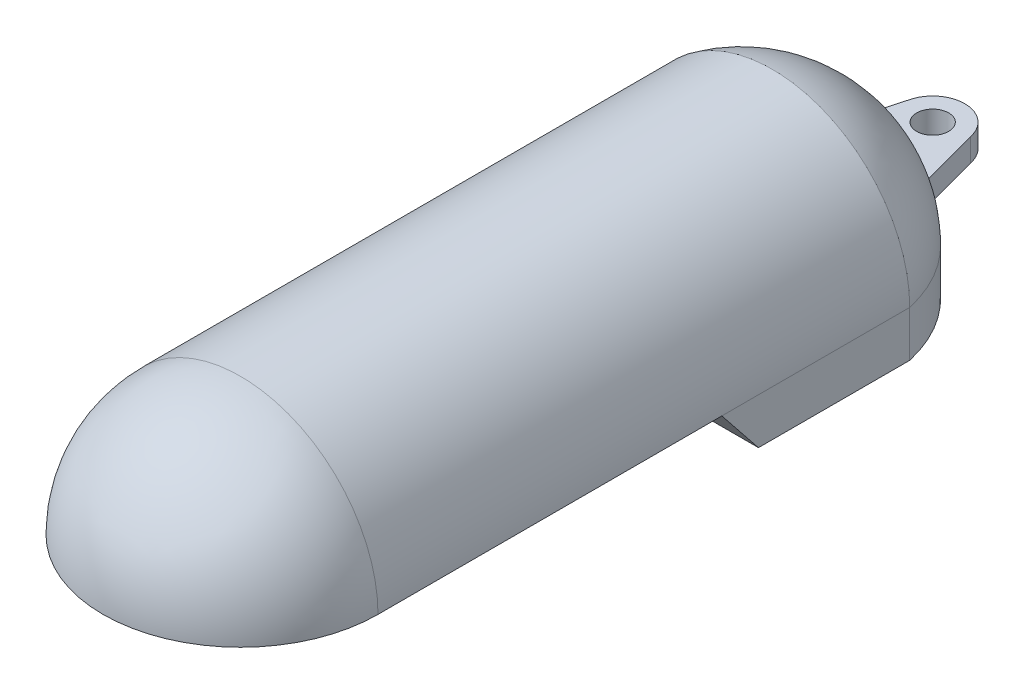
ISO-10303-21;
HEADER;
FILE_DESCRIPTION(('STEP AP214'),'2;1');
FILE_NAME('part.step','',(''),(''),'','','');
FILE_SCHEMA(('AUTOMOTIVE_DESIGN { 1 0 10303 214 1 1 1 1 }'));
ENDSEC;
DATA;
#1=APPLICATION_CONTEXT('core data for automotive mechanical design processes');
#2=APPLICATION_PROTOCOL_DEFINITION('international standard','automotive_design',2000,#1);
#3=PRODUCT_CONTEXT('',#1,'mechanical');
#4=PRODUCT('Part','Part','',(#3));
#5=PRODUCT_RELATED_PRODUCT_CATEGORY('part','',(#4));
#6=PRODUCT_DEFINITION_FORMATION('','',#4);
#7=PRODUCT_DEFINITION_CONTEXT('part definition',#1,'design');
#8=PRODUCT_DEFINITION('design','',#6,#7);
#9=PRODUCT_DEFINITION_SHAPE('','',#8);
#10=(LENGTH_UNIT() NAMED_UNIT(*) SI_UNIT(.MILLI.,.METRE.));
#11=(NAMED_UNIT(*) PLANE_ANGLE_UNIT() SI_UNIT($,.RADIAN.));
#12=(NAMED_UNIT(*) SI_UNIT($,.STERADIAN.) SOLID_ANGLE_UNIT());
#13=UNCERTAINTY_MEASURE_WITH_UNIT(LENGTH_MEASURE(1.E-05),#10,'distance_accuracy_value','');
#14=(GEOMETRIC_REPRESENTATION_CONTEXT(3) GLOBAL_UNCERTAINTY_ASSIGNED_CONTEXT((#13)) GLOBAL_UNIT_ASSIGNED_CONTEXT((#10,
#11,#12)) REPRESENTATION_CONTEXT('',''));
#15=CARTESIAN_POINT('',(0.,0.,0.));
#16=DIRECTION('',(0.,0.,1.));
#17=DIRECTION('',(1.,0.,0.));
#18=AXIS2_PLACEMENT_3D('',#15,#16,#17);
#19=CARTESIAN_POINT('',(0.,-2.5,-34.25));
#20=DIRECTION('',(0.,1.,0.));
#21=DIRECTION('',(-1.,0.,0.));
#22=AXIS2_PLACEMENT_3D('',#19,#20,#21);
#23=PLANE('',#22);
#24=CARTESIAN_POINT('',(0.,-2.49999999999999,-76.));
#25=DIRECTION('',(0.,1.,0.));
#26=DIRECTION('',(-1.,0.,0.));
#27=AXIS2_PLACEMENT_3D('',#24,#25,#26);
#28=CIRCLE('',#27,3.49999999999999);
#29=CARTESIAN_POINT('',(-3.49999999999999,-2.49999999999999,-76.));
#30=VERTEX_POINT('',#29);
#31=EDGE_CURVE('E340',#30,#30,#28,.T.);
#32=ORIENTED_EDGE('',*,*,#31,.T.);
#33=EDGE_LOOP('',(#32));
#34=FACE_BOUND('',#33,.T.);
#35=CARTESIAN_POINT('',(0.,-2.5,-34.25));
#36=DIRECTION('',(0.,-1.,0.));
#37=DIRECTION('',(-1.,0.,0.));
#38=AXIS2_PLACEMENT_3D('',#35,#36,#37);
#39=CIRCLE('',#38,30.75);
#40=CARTESIAN_POINT('',(-10.7113662336025,-2.5,-63.0741068102663));
#41=VERTEX_POINT('',#40);
#42=CARTESIAN_POINT('',(10.7113662336025,-2.49999999999999,-63.0741068102663));
#43=VERTEX_POINT('',#42);
#44=EDGE_CURVE('E100',#41,#43,#39,.T.);
#45=ORIENTED_EDGE('',*,*,#44,.F.);
#46=DIRECTION('',(0.259513331356118,0.,-0.96573952536305));
#47=VECTOR('',#46,1.);
#48=CARTESIAN_POINT('',(-6.84778669830212,-2.5,-77.4518324058089));
#49=LINE('',#48,#47);
#50=CARTESIAN_POINT('',(-6.84778669830211,-2.5,-77.4518324058089));
#51=VERTEX_POINT('',#50);
#52=EDGE_CURVE('E310',#41,#51,#49,.T.);
#53=ORIENTED_EDGE('',*,*,#52,.T.);
#54=CARTESIAN_POINT('',(0.,-2.49999999999999,-76.));
#55=DIRECTION('',(0.,-1.,0.));
#56=DIRECTION('',(-1.,0.,0.));
#57=AXIS2_PLACEMENT_3D('',#54,#55,#56);
#58=CIRCLE('',#57,7.00000000000001);
#59=CARTESIAN_POINT('',(6.84778669830212,-2.49999999999999,-77.4518324058088));
#60=VERTEX_POINT('',#59);
#61=EDGE_CURVE('E314',#51,#60,#58,.T.);
#62=ORIENTED_EDGE('',*,*,#61,.T.);
#63=DIRECTION('',(0.259513331356118,0.,0.96573952536305));
#64=VECTOR('',#63,1.);
#65=CARTESIAN_POINT('',(10.7113662336025,-2.49999999999999,-63.0741068102663));
#66=LINE('',#65,#64);
#67=EDGE_CURVE('E307',#60,#43,#66,.T.);
#68=ORIENTED_EDGE('',*,*,#67,.T.);
#69=EDGE_LOOP('',(#45,#53,#62,#68));
#70=FACE_BOUND('',#69,.T.);
#71=ADVANCED_FACE('F50',(#34,#70),#23,.F.);
#72=CARTESIAN_POINT('',(10.,0.,20.));
#73=DIRECTION('',(0.,-1.,0.));
#74=DIRECTION('',(0.,0.,-1.));
#75=AXIS2_PLACEMENT_3D('',#72,#73,#74);
#76=PLANE('',#75);
#77=DIRECTION('',(0.,0.,-1.));
#78=VECTOR('',#77,1.);
#79=CARTESIAN_POINT('',(-28.,0.,75.));
#80=LINE('',#79,#78);
#81=CARTESIAN_POINT('',(-28.,0.,75.));
#82=VERTEX_POINT('',#81);
#83=CARTESIAN_POINT('',(-28.,0.,2.));
#84=VERTEX_POINT('',#83);
#85=EDGE_CURVE('E331',#82,#84,#80,.T.);
#86=ORIENTED_EDGE('',*,*,#85,.F.);
#87=CARTESIAN_POINT('',(0.,0.,75.));
#88=DIRECTION('',(0.,-1.,0.));
#89=DIRECTION('',(-1.,0.,0.));
#90=AXIS2_PLACEMENT_3D('',#87,#88,#89);
#91=CIRCLE('',#90,28.);
#92=CARTESIAN_POINT('',(28.,0.,75.));
#93=VERTEX_POINT('',#92);
#94=EDGE_CURVE('E159',#93,#82,#91,.T.);
#95=ORIENTED_EDGE('',*,*,#94,.F.);
#96=DIRECTION('',(0.,0.,-1.));
#97=VECTOR('',#96,1.);
#98=CARTESIAN_POINT('',(28.,0.,75.));
#99=LINE('',#98,#97);
#100=CARTESIAN_POINT('',(28.,0.,2.));
#101=VERTEX_POINT('',#100);
#102=EDGE_CURVE('E66',#101,#93,#99,.F.);
#103=ORIENTED_EDGE('',*,*,#102,.F.);
#104=DIRECTION('',(1.,0.,0.));
#105=VECTOR('',#104,1.);
#106=CARTESIAN_POINT('',(10.,0.,2.00000000000001));
#107=LINE('',#106,#105);
#108=EDGE_CURVE('E12',#84,#101,#107,.T.);
#109=ORIENTED_EDGE('',*,*,#108,.F.);
#110=EDGE_LOOP('',(#86,#95,#103,#109));
#111=FACE_BOUND('',#110,.T.);
#112=DIRECTION('',(0.,0.,1.));
#113=VECTOR('',#112,1.);
#114=CARTESIAN_POINT('',(-30.,0.,37.5));
#115=LINE('',#114,#113);
#116=CARTESIAN_POINT('',(-30.,0.,0.));
#117=VERTEX_POINT('',#116);
#118=CARTESIAN_POINT('',(-30.,0.,75.));
#119=VERTEX_POINT('',#118);
#120=EDGE_CURVE('E75',#117,#119,#115,.T.);
#121=ORIENTED_EDGE('',*,*,#120,.F.);
#122=DIRECTION('',(-1.,0.,0.));
#123=VECTOR('',#122,1.);
#124=CARTESIAN_POINT('',(-30.,0.,0.));
#125=LINE('',#124,#123);
#126=CARTESIAN_POINT('',(30.,0.,0.));
#127=VERTEX_POINT('',#126);
#128=EDGE_CURVE('E145',#127,#117,#125,.T.);
#129=ORIENTED_EDGE('',*,*,#128,.F.);
#130=DIRECTION('',(0.,0.,1.));
#131=VECTOR('',#130,1.);
#132=CARTESIAN_POINT('',(30.,0.,37.5));
#133=LINE('',#132,#131);
#134=CARTESIAN_POINT('',(30.,0.,75.));
#135=VERTEX_POINT('',#134);
#136=EDGE_CURVE('E139',#127,#135,#133,.T.);
#137=ORIENTED_EDGE('',*,*,#136,.T.);
#138=CARTESIAN_POINT('',(0.,0.,75.));
#139=DIRECTION('',(0.,-1.,0.));
#140=DIRECTION('',(-1.,0.,0.));
#141=AXIS2_PLACEMENT_3D('',#138,#139,#140);
#142=CIRCLE('',#141,30.);
#143=EDGE_CURVE('E143',#135,#119,#142,.T.);
#144=ORIENTED_EDGE('',*,*,#143,.T.);
#145=EDGE_LOOP('',(#121,#129,#137,#144));
#146=FACE_BOUND('',#145,.T.);
#147=ADVANCED_FACE('F141',(#111,#146),#76,.T.);
#148=CARTESIAN_POINT('',(0.,0.,52.5));
#149=DIRECTION('',(0.,0.,1.));
#150=DIRECTION('',(0.,-1.,0.));
#151=AXIS2_PLACEMENT_3D('',#148,#149,#150);
#152=CYLINDRICAL_SURFACE('',#151,30.);
#153=CARTESIAN_POINT('',(0.,0.,75.));
#154=DIRECTION('',(0.,0.,1.));
#155=DIRECTION('',(0.,-1.,0.));
#156=AXIS2_PLACEMENT_3D('',#153,#154,#155);
#157=CIRCLE('',#156,30.);
#158=EDGE_CURVE('E152',#135,#119,#157,.T.);
#159=ORIENTED_EDGE('',*,*,#158,.F.);
#160=ORIENTED_EDGE('',*,*,#136,.F.);
#161=CARTESIAN_POINT('',(30.,0.,-41.));
#162=VERTEX_POINT('',#161);
#163=EDGE_CURVE('E149',#162,#127,#133,.T.);
#164=ORIENTED_EDGE('',*,*,#163,.F.);
#165=CARTESIAN_POINT('',(0.,0.,-41.));
#166=DIRECTION('',(0.,0.,1.));
#167=DIRECTION('',(0.,-1.,0.));
#168=AXIS2_PLACEMENT_3D('',#165,#166,#167);
#169=CIRCLE('',#168,30.);
#170=CARTESIAN_POINT('',(-30.,0.,-41.));
#171=VERTEX_POINT('',#170);
#172=EDGE_CURVE('E150',#162,#171,#169,.T.);
#173=ORIENTED_EDGE('',*,*,#172,.T.);
#174=EDGE_CURVE('E170',#171,#117,#115,.T.);
#175=ORIENTED_EDGE('',*,*,#174,.T.);
#176=ORIENTED_EDGE('',*,*,#120,.T.);
#177=EDGE_LOOP('',(#159,#160,#164,#173,#175,#176));
#178=FACE_BOUND('',#177,.T.);
#179=ADVANCED_FACE('F153',(#178),#152,.T.);
#180=CARTESIAN_POINT('',(0.,0.,75.));
#181=DIRECTION('',(0.,0.,1.));
#182=DIRECTION('',(1.,0.,0.));
#183=AXIS2_PLACEMENT_3D('',#180,#181,#182);
#184=SPHERICAL_SURFACE('',#183,30.);
#185=ORIENTED_EDGE('',*,*,#158,.T.);
#186=ORIENTED_EDGE('',*,*,#143,.F.);
#187=EDGE_LOOP('',(#185,#186));
#188=FACE_BOUND('',#187,.T.);
#189=ADVANCED_FACE('F157',(#188),#184,.T.);
#190=CARTESIAN_POINT('',(0.,0.,75.));
#191=DIRECTION('',(0.,0.,1.));
#192=DIRECTION('',(1.,0.,0.));
#193=AXIS2_PLACEMENT_3D('',#190,#191,#192);
#194=SPHERICAL_SURFACE('',#193,28.);
#195=CARTESIAN_POINT('',(0.,0.,75.));
#196=DIRECTION('',(0.,0.,1.));
#197=DIRECTION('',(0.,-1.,0.));
#198=AXIS2_PLACEMENT_3D('',#195,#196,#197);
#199=CIRCLE('',#198,28.);
#200=EDGE_CURVE('E59',#93,#82,#199,.T.);
#201=ORIENTED_EDGE('',*,*,#200,.F.);
#202=ORIENTED_EDGE('',*,*,#94,.T.);
#203=EDGE_LOOP('',(#201,#202));
#204=FACE_BOUND('',#203,.T.);
#205=ADVANCED_FACE('F400',(#204),#194,.F.);
#206=CARTESIAN_POINT('',(0.,0.,-34.25));
#207=DIRECTION('',(0.,0.,1.));
#208=DIRECTION('',(1.,0.,0.));
#209=AXIS2_PLACEMENT_3D('',#206,#207,#208);
#210=SPHERICAL_SURFACE('',#209,30.75);
#211=CARTESIAN_POINT('',(0.,0.,-34.25));
#212=DIRECTION('',(0.,-1.,0.));
#213=DIRECTION('',(-1.,0.,0.));
#214=AXIS2_PLACEMENT_3D('',#211,#212,#213);
#215=CIRCLE('',#214,30.75);
#216=CARTESIAN_POINT('',(10.7113662336025,0.,-63.0741068102663));
#217=VERTEX_POINT('',#216);
#218=EDGE_CURVE('E262',#217,#162,#215,.T.);
#219=ORIENTED_EDGE('',*,*,#218,.F.);
#220=CARTESIAN_POINT('',(17.2139494495494,0.,-38.8757290398972));
#221=DIRECTION('',(0.965739525363051,0.,-0.259513331356117));
#222=DIRECTION('',(-0.259513331356117,0.,-0.965739525363051));
#223=AXIS2_PLACEMENT_3D('',#220,#221,#222);
#224=CIRCLE('',#223,25.0568368953029);
#225=CARTESIAN_POINT('',(10.743812768372,2.5,-62.9533619493983));
#226=VERTEX_POINT('',#225);
#227=EDGE_CURVE('E260',#217,#226,#224,.T.);
#228=ORIENTED_EDGE('',*,*,#227,.T.);
#229=CARTESIAN_POINT('',(0.,2.5,-34.25));
#230=DIRECTION('',(0.,1.,0.));
#231=DIRECTION('',(1.,0.,0.));
#232=AXIS2_PLACEMENT_3D('',#229,#230,#231);
#233=CIRCLE('',#232,30.64820549396);
#234=CARTESIAN_POINT('',(-10.743812768372,2.5,-62.9533619493983));
#235=VERTEX_POINT('',#234);
#236=EDGE_CURVE('E257',#226,#235,#233,.T.);
#237=ORIENTED_EDGE('',*,*,#236,.T.);
#238=CARTESIAN_POINT('',(-17.2139494495494,0.,-38.8757290398972));
#239=DIRECTION('',(0.96573952536305,0.,0.259513331356118));
#240=DIRECTION('',(0.259513331356118,0.,-0.96573952536305));
#241=AXIS2_PLACEMENT_3D('',#238,#239,#240);
#242=CIRCLE('',#241,25.0568368953029);
#243=CARTESIAN_POINT('',(-10.7113662336025,0.,-63.0741068102663));
#244=VERTEX_POINT('',#243);
#245=EDGE_CURVE('E253',#244,#235,#242,.T.);
#246=ORIENTED_EDGE('',*,*,#245,.F.);
#247=EDGE_CURVE('E252',#171,#244,#215,.T.);
#248=ORIENTED_EDGE('',*,*,#247,.F.);
#249=ORIENTED_EDGE('',*,*,#172,.F.);
#250=EDGE_LOOP('',(#219,#228,#237,#246,#248,#249));
#251=FACE_BOUND('',#250,.T.);
#252=ADVANCED_FACE('F277',(#251),#210,.T.);
#253=CARTESIAN_POINT('',(8.92389334915106,-2.5,-69.7259162029044));
#254=DIRECTION('',(0.965739525363051,0.,-0.259513331356117));
#255=DIRECTION('',(-0.259513331356117,0.,-0.965739525363051));
#256=AXIS2_PLACEMENT_3D('',#253,#254,#255);
#257=PLANE('',#256);
#258=ORIENTED_EDGE('',*,*,#227,.F.);
#259=DIRECTION('',(0.,1.,0.));
#260=VECTOR('',#259,1.);
#261=CARTESIAN_POINT('',(10.7113662336025,-2.49999999999999,-63.0741068102663));
#262=LINE('',#261,#260);
#263=EDGE_CURVE('E301',#43,#217,#262,.T.);
#264=ORIENTED_EDGE('',*,*,#263,.F.);
#265=ORIENTED_EDGE('',*,*,#67,.F.);
#266=DIRECTION('',(0.,1.,0.));
#267=VECTOR('',#266,1.);
#268=CARTESIAN_POINT('',(6.84778669830212,-2.5,-77.4518324058088));
#269=LINE('',#268,#267);
#270=CARTESIAN_POINT('',(6.84778669830212,2.5,-77.4518324058088));
#271=VERTEX_POINT('',#270);
#272=EDGE_CURVE('E249',#60,#271,#269,.T.);
#273=ORIENTED_EDGE('',*,*,#272,.T.);
#274=DIRECTION('',(-0.259513331356117,0.,-0.965739525363051));
#275=VECTOR('',#274,1.);
#276=CARTESIAN_POINT('',(8.92389334915106,2.5,-69.7259162029044));
#277=LINE('',#276,#275);
#278=EDGE_CURVE('E245',#226,#271,#277,.T.);
#279=ORIENTED_EDGE('',*,*,#278,.F.);
#280=EDGE_LOOP('',(#258,#264,#265,#273,#279));
#281=FACE_BOUND('',#280,.T.);
#282=ADVANCED_FACE('F369',(#281),#257,.T.);
#283=CARTESIAN_POINT('',(-8.92389334915106,-2.5,-69.7259162029045));
#284=DIRECTION('',(0.96573952536305,0.,0.259513331356118));
#285=DIRECTION('',(0.259513331356118,0.,-0.965739525363051));
#286=AXIS2_PLACEMENT_3D('',#283,#284,#285);
#287=PLANE('',#286);
#288=DIRECTION('',(0.,1.,0.));
#289=VECTOR('',#288,1.);
#290=CARTESIAN_POINT('',(-6.84778669830212,-2.5,-77.4518324058089));
#291=LINE('',#290,#289);
#292=CARTESIAN_POINT('',(-6.84778669830212,2.5,-77.4518324058089));
#293=VERTEX_POINT('',#292);
#294=EDGE_CURVE('E235',#51,#293,#291,.T.);
#295=ORIENTED_EDGE('',*,*,#294,.F.);
#296=ORIENTED_EDGE('',*,*,#52,.F.);
#297=DIRECTION('',(0.,1.,0.));
#298=VECTOR('',#297,1.);
#299=CARTESIAN_POINT('',(-10.7113662336025,-2.5,-63.0741068102663));
#300=LINE('',#299,#298);
#301=EDGE_CURVE('E295',#41,#244,#300,.T.);
#302=ORIENTED_EDGE('',*,*,#301,.T.);
#303=ORIENTED_EDGE('',*,*,#245,.T.);
#304=DIRECTION('',(0.259513331356118,0.,-0.96573952536305));
#305=VECTOR('',#304,1.);
#306=CARTESIAN_POINT('',(-8.92389334915106,2.5,-69.7259162029045));
#307=LINE('',#306,#305);
#308=EDGE_CURVE('E241',#235,#293,#307,.T.);
#309=ORIENTED_EDGE('',*,*,#308,.T.);
#310=EDGE_LOOP('',(#295,#296,#302,#303,#309));
#311=FACE_BOUND('',#310,.T.);
#312=ADVANCED_FACE('F364',(#311),#287,.F.);
#313=CARTESIAN_POINT('',(0.,-2.5,-76.));
#314=DIRECTION('',(0.,1.,0.));
#315=DIRECTION('',(1.,0.,0.));
#316=AXIS2_PLACEMENT_3D('',#313,#314,#315);
#317=CYLINDRICAL_SURFACE('',#316,7.);
#318=ORIENTED_EDGE('',*,*,#272,.F.);
#319=ORIENTED_EDGE('',*,*,#61,.F.);
#320=ORIENTED_EDGE('',*,*,#294,.T.);
#321=CARTESIAN_POINT('',(0.,2.5,-76.));
#322=DIRECTION('',(0.,-1.,0.));
#323=DIRECTION('',(1.,0.,0.));
#324=AXIS2_PLACEMENT_3D('',#321,#322,#323);
#325=CIRCLE('',#324,7.);
#326=EDGE_CURVE('E229',#293,#271,#325,.T.);
#327=ORIENTED_EDGE('',*,*,#326,.T.);
#328=EDGE_LOOP('',(#318,#319,#320,#327));
#329=FACE_BOUND('',#328,.T.);
#330=ADVANCED_FACE('F356',(#329),#317,.T.);
#331=CARTESIAN_POINT('',(0.,2.5,-41.5));
#332=DIRECTION('',(0.,1.,0.));
#333=DIRECTION('',(1.,0.,0.));
#334=AXIS2_PLACEMENT_3D('',#331,#332,#333);
#335=PLANE('',#334);
#336=CARTESIAN_POINT('',(0.,2.5,-76.));
#337=DIRECTION('',(0.,1.,0.));
#338=DIRECTION('',(0.,0.,1.));
#339=AXIS2_PLACEMENT_3D('',#336,#337,#338);
#340=CIRCLE('',#339,3.49999999999999);
#341=CARTESIAN_POINT('',(0.,2.5,-72.5));
#342=VERTEX_POINT('',#341);
#343=EDGE_CURVE('E344',#342,#342,#340,.T.);
#344=ORIENTED_EDGE('',*,*,#343,.F.);
#345=EDGE_LOOP('',(#344));
#346=FACE_BOUND('',#345,.T.);
#347=ORIENTED_EDGE('',*,*,#236,.F.);
#348=ORIENTED_EDGE('',*,*,#278,.T.);
#349=ORIENTED_EDGE('',*,*,#326,.F.);
#350=ORIENTED_EDGE('',*,*,#308,.F.);
#351=EDGE_LOOP('',(#347,#348,#349,#350));
#352=FACE_BOUND('',#351,.T.);
#353=ADVANCED_FACE('F353',(#346,#352),#335,.T.);
#354=CARTESIAN_POINT('',(0.,-2.5,-34.25));
#355=DIRECTION('',(0.,1.,0.));
#356=DIRECTION('',(-1.,0.,0.));
#357=AXIS2_PLACEMENT_3D('',#354,#355,#356);
#358=CYLINDRICAL_SURFACE('',#357,30.75);
#359=ORIENTED_EDGE('',*,*,#218,.T.);
#360=DIRECTION('',(0.,1.,0.));
#361=VECTOR('',#360,1.);
#362=CARTESIAN_POINT('',(30.,-2.49999999999999,-41.));
#363=LINE('',#362,#361);
#364=CARTESIAN_POINT('',(30.,-9.99999999999999,-41.));
#365=VERTEX_POINT('',#364);
#366=EDGE_CURVE('E236',#365,#162,#363,.T.);
#367=ORIENTED_EDGE('',*,*,#366,.F.);
#368=CARTESIAN_POINT('',(0.,-10.,-34.25));
#369=DIRECTION('',(0.,-1.,0.));
#370=DIRECTION('',(-1.,0.,0.));
#371=AXIS2_PLACEMENT_3D('',#368,#369,#370);
#372=CIRCLE('',#371,30.75);
#373=CARTESIAN_POINT('',(-30.,-10.,-41.));
#374=VERTEX_POINT('',#373);
#375=EDGE_CURVE('E292',#374,#365,#372,.T.);
#376=ORIENTED_EDGE('',*,*,#375,.F.);
#377=DIRECTION('',(0.,1.,0.));
#378=VECTOR('',#377,1.);
#379=CARTESIAN_POINT('',(-30.,-2.50000000000001,-41.));
#380=LINE('',#379,#378);
#381=EDGE_CURVE('E286',#374,#171,#380,.T.);
#382=ORIENTED_EDGE('',*,*,#381,.T.);
#383=ORIENTED_EDGE('',*,*,#247,.T.);
#384=ORIENTED_EDGE('',*,*,#301,.F.);
#385=ORIENTED_EDGE('',*,*,#44,.T.);
#386=ORIENTED_EDGE('',*,*,#263,.T.);
#387=EDGE_LOOP('',(#359,#367,#376,#382,#383,#384,#385,#386));
#388=FACE_BOUND('',#387,.T.);
#389=ADVANCED_FACE('F289',(#388),#358,.T.);
#390=CARTESIAN_POINT('',(30.,-2.49999999999999,0.));
#391=DIRECTION('',(-1.,0.,0.));
#392=DIRECTION('',(0.,-1.,0.));
#393=AXIS2_PLACEMENT_3D('',#390,#391,#392);
#394=PLANE('',#393);
#395=ORIENTED_EDGE('',*,*,#163,.T.);
#396=DIRECTION('',(0.,-0.780868809443028,-0.624695047554427));
#397=VECTOR('',#396,1.);
#398=CARTESIAN_POINT('',(30.,0.,0.));
#399=LINE('',#398,#397);
#400=CARTESIAN_POINT('',(30.,-9.99999999999999,-8.00000000000006));
#401=VERTEX_POINT('',#400);
#402=EDGE_CURVE('E299',#401,#127,#399,.F.);
#403=ORIENTED_EDGE('',*,*,#402,.F.);
#404=DIRECTION('',(0.,0.,1.));
#405=VECTOR('',#404,1.);
#406=CARTESIAN_POINT('',(30.,-9.99999999999999,0.));
#407=LINE('',#406,#405);
#408=EDGE_CURVE('E322',#365,#401,#407,.T.);
#409=ORIENTED_EDGE('',*,*,#408,.F.);
#410=ORIENTED_EDGE('',*,*,#366,.T.);
#411=EDGE_LOOP('',(#395,#403,#409,#410));
#412=FACE_BOUND('',#411,.T.);
#413=ADVANCED_FACE('F386',(#412),#394,.F.);
#414=CARTESIAN_POINT('',(-30.,0.,0.));
#415=DIRECTION('',(0.,-0.624695047554427,0.780868809443028));
#416=DIRECTION('',(0.,-0.780868809443028,-0.624695047554427));
#417=AXIS2_PLACEMENT_3D('',#414,#415,#416);
#418=PLANE('',#417);
#419=ORIENTED_EDGE('',*,*,#128,.T.);
#420=DIRECTION('',(0.,-0.780868809443028,-0.624695047554427));
#421=VECTOR('',#420,1.);
#422=CARTESIAN_POINT('',(-30.,-21.5243902439025,-17.2195121951221));
#423=LINE('',#422,#421);
#424=CARTESIAN_POINT('',(-30.,-10.,-8.00000000000006));
#425=VERTEX_POINT('',#424);
#426=EDGE_CURVE('E91',#425,#117,#423,.F.);
#427=ORIENTED_EDGE('',*,*,#426,.F.);
#428=DIRECTION('',(1.,0.,0.));
#429=VECTOR('',#428,1.);
#430=CARTESIAN_POINT('',(0.,-10.,-8.00000000000006));
#431=LINE('',#430,#429);
#432=EDGE_CURVE('E311',#401,#425,#431,.F.);
#433=ORIENTED_EDGE('',*,*,#432,.F.);
#434=ORIENTED_EDGE('',*,*,#402,.T.);
#435=EDGE_LOOP('',(#419,#427,#433,#434));
#436=FACE_BOUND('',#435,.T.);
#437=ADVANCED_FACE('F52',(#436),#418,.T.);
#438=CARTESIAN_POINT('',(-30.,-2.50000000000001,-41.));
#439=DIRECTION('',(1.,0.,0.));
#440=DIRECTION('',(0.,1.,0.));
#441=AXIS2_PLACEMENT_3D('',#438,#439,#440);
#442=PLANE('',#441);
#443=ORIENTED_EDGE('',*,*,#174,.F.);
#444=ORIENTED_EDGE('',*,*,#381,.F.);
#445=DIRECTION('',(0.,0.,-1.));
#446=VECTOR('',#445,1.);
#447=CARTESIAN_POINT('',(-30.,-10.,-41.));
#448=LINE('',#447,#446);
#449=EDGE_CURVE('E328',#425,#374,#448,.T.);
#450=ORIENTED_EDGE('',*,*,#449,.F.);
#451=ORIENTED_EDGE('',*,*,#426,.T.);
#452=EDGE_LOOP('',(#443,#444,#450,#451));
#453=FACE_BOUND('',#452,.T.);
#454=ADVANCED_FACE('F283',(#453),#442,.F.);
#455=CARTESIAN_POINT('',(0.,-10.,-34.25));
#456=DIRECTION('',(0.,1.,0.));
#457=DIRECTION('',(-1.,0.,0.));
#458=AXIS2_PLACEMENT_3D('',#455,#456,#457);
#459=PLANE('',#458);
#460=ORIENTED_EDGE('',*,*,#449,.T.);
#461=ORIENTED_EDGE('',*,*,#375,.T.);
#462=ORIENTED_EDGE('',*,*,#408,.T.);
#463=ORIENTED_EDGE('',*,*,#432,.T.);
#464=EDGE_LOOP('',(#460,#461,#462,#463));
#465=FACE_BOUND('',#464,.T.);
#466=ADVANCED_FACE('F382',(#465),#459,.F.);
#467=CARTESIAN_POINT('',(0.,0.,75.));
#468=DIRECTION('',(0.,0.,-1.));
#469=DIRECTION('',(0.,1.,0.));
#470=AXIS2_PLACEMENT_3D('',#467,#468,#469);
#471=CYLINDRICAL_SURFACE('',#470,28.);
#472=ORIENTED_EDGE('',*,*,#85,.T.);
#473=CARTESIAN_POINT('',(0.,0.,2.));
#474=DIRECTION('',(0.,0.,-1.));
#475=DIRECTION('',(0.,1.,0.));
#476=AXIS2_PLACEMENT_3D('',#473,#474,#475);
#477=CIRCLE('',#476,28.);
#478=EDGE_CURVE('E337',#84,#101,#477,.T.);
#479=ORIENTED_EDGE('',*,*,#478,.T.);
#480=ORIENTED_EDGE('',*,*,#102,.T.);
#481=ORIENTED_EDGE('',*,*,#200,.T.);
#482=EDGE_LOOP('',(#472,#479,#480,#481));
#483=FACE_BOUND('',#482,.T.);
#484=ADVANCED_FACE('F460',(#483),#471,.F.);
#485=CARTESIAN_POINT('',(0.,0.,2.));
#486=DIRECTION('',(0.,0.,-1.));
#487=DIRECTION('',(0.,1.,0.));
#488=AXIS2_PLACEMENT_3D('',#485,#486,#487);
#489=PLANE('',#488);
#490=ORIENTED_EDGE('',*,*,#108,.T.);
#491=ORIENTED_EDGE('',*,*,#478,.F.);
#492=EDGE_LOOP('',(#490,#491));
#493=FACE_BOUND('',#492,.T.);
#494=ADVANCED_FACE('F476',(#493),#489,.F.);
#495=CARTESIAN_POINT('',(0.,2.5,-76.));
#496=DIRECTION('',(0.,1.,0.));
#497=DIRECTION('',(0.,0.,1.));
#498=AXIS2_PLACEMENT_3D('',#495,#496,#497);
#499=CYLINDRICAL_SURFACE('',#498,3.49999999999999);
#500=ORIENTED_EDGE('',*,*,#343,.T.);
#501=EDGE_LOOP('',(#500));
#502=FACE_BOUND('',#501,.T.);
#503=ORIENTED_EDGE('',*,*,#31,.F.);
#504=EDGE_LOOP('',(#503));
#505=FACE_BOUND('',#504,.T.);
#506=ADVANCED_FACE('F350',(#502,#505),#499,.F.);
#507=CLOSED_SHELL('',(#71,#147,#179,#189,#205,#252,#282,#312,#330,#353,#389,#413,#437,#454,#466,
#484,#494,#506));
#508=MANIFOLD_SOLID_BREP('B2',#507);
#509=ADVANCED_BREP_SHAPE_REPRESENTATION('',(#18,#508),#14);
#510=SHAPE_DEFINITION_REPRESENTATION(#9,#509);
ENDSEC;
END-ISO-10303-21;
